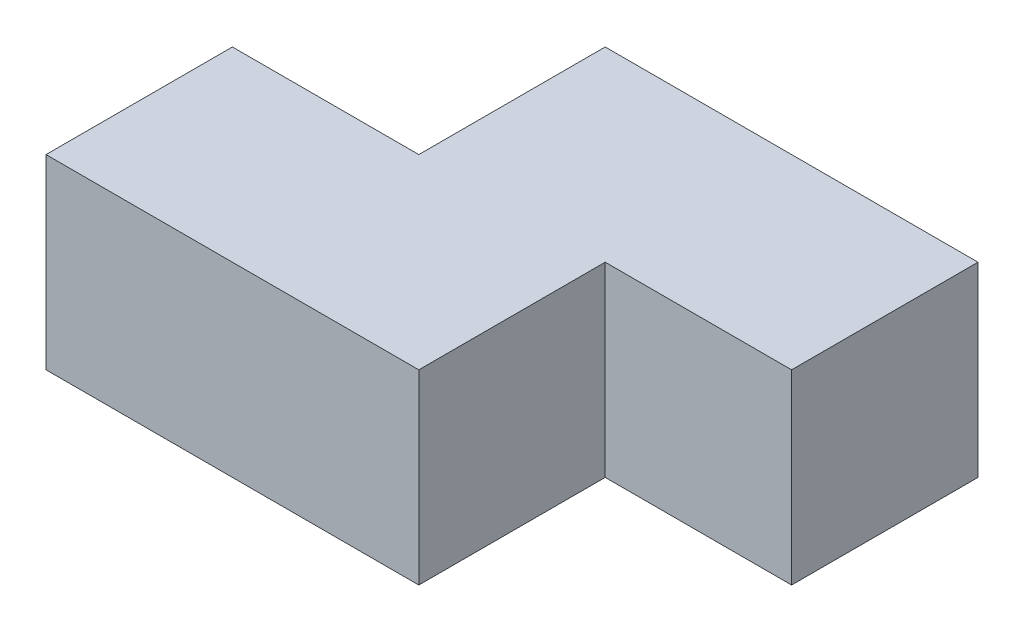
ISO-10303-21;
HEADER;
FILE_DESCRIPTION(('STEP AP214'),'2;1');
FILE_NAME('part.step','',(''),(''),'','','');
FILE_SCHEMA(('AUTOMOTIVE_DESIGN { 1 0 10303 214 1 1 1 1 }'));
ENDSEC;
DATA;
#1=APPLICATION_CONTEXT('core data for automotive mechanical design processes');
#2=APPLICATION_PROTOCOL_DEFINITION('international standard','automotive_design',2000,#1);
#3=PRODUCT_CONTEXT('',#1,'mechanical');
#4=PRODUCT('Part','Part','',(#3));
#5=PRODUCT_RELATED_PRODUCT_CATEGORY('part','',(#4));
#6=PRODUCT_DEFINITION_FORMATION('','',#4);
#7=PRODUCT_DEFINITION_CONTEXT('part definition',#1,'design');
#8=PRODUCT_DEFINITION('design','',#6,#7);
#9=PRODUCT_DEFINITION_SHAPE('','',#8);
#10=(LENGTH_UNIT() NAMED_UNIT(*) SI_UNIT(.MILLI.,.METRE.));
#11=(NAMED_UNIT(*) PLANE_ANGLE_UNIT() SI_UNIT($,.RADIAN.));
#12=(NAMED_UNIT(*) SI_UNIT($,.STERADIAN.) SOLID_ANGLE_UNIT());
#13=UNCERTAINTY_MEASURE_WITH_UNIT(LENGTH_MEASURE(1.E-05),#10,'distance_accuracy_value','');
#14=(GEOMETRIC_REPRESENTATION_CONTEXT(3) GLOBAL_UNCERTAINTY_ASSIGNED_CONTEXT((#13)) GLOBAL_UNIT_ASSIGNED_CONTEXT((#10,
#11,#12)) REPRESENTATION_CONTEXT('',''));
#15=CARTESIAN_POINT('',(0.,0.,0.));
#16=DIRECTION('',(0.,0.,1.));
#17=DIRECTION('',(1.,0.,0.));
#18=AXIS2_PLACEMENT_3D('',#15,#16,#17);
#19=CARTESIAN_POINT('',(0.,200.,0.));
#20=DIRECTION('',(1.,0.,0.));
#21=DIRECTION('',(0.,0.,-1.));
#22=AXIS2_PLACEMENT_3D('',#19,#20,#21);
#23=PLANE('',#22);
#24=DIRECTION('',(0.,0.,1.));
#25=VECTOR('',#24,1.);
#26=CARTESIAN_POINT('',(0.,0.,0.));
#27=LINE('',#26,#25);
#28=CARTESIAN_POINT('',(0.,0.,-200.));
#29=VERTEX_POINT('',#28);
#30=CARTESIAN_POINT('',(0.,0.,0.));
#31=VERTEX_POINT('',#30);
#32=EDGE_CURVE('E140',#29,#31,#27,.T.);
#33=ORIENTED_EDGE('',*,*,#32,.T.);
#34=DIRECTION('',(0.,-1.,0.));
#35=VECTOR('',#34,1.);
#36=CARTESIAN_POINT('',(0.,200.,0.));
#37=LINE('',#36,#35);
#38=CARTESIAN_POINT('',(0.,200.,0.));
#39=VERTEX_POINT('',#38);
#40=EDGE_CURVE('E11',#39,#31,#37,.T.);
#41=ORIENTED_EDGE('',*,*,#40,.F.);
#42=DIRECTION('',(0.,0.,1.));
#43=VECTOR('',#42,1.);
#44=CARTESIAN_POINT('',(0.,200.,0.));
#45=LINE('',#44,#43);
#46=CARTESIAN_POINT('',(0.,200.,-200.));
#47=VERTEX_POINT('',#46);
#48=EDGE_CURVE('E162',#47,#39,#45,.T.);
#49=ORIENTED_EDGE('',*,*,#48,.F.);
#50=DIRECTION('',(0.,-1.,0.));
#51=VECTOR('',#50,1.);
#52=CARTESIAN_POINT('',(0.,200.,-200.));
#53=LINE('',#52,#51);
#54=EDGE_CURVE('E136',#47,#29,#53,.T.);
#55=ORIENTED_EDGE('',*,*,#54,.T.);
#56=EDGE_LOOP('',(#33,#41,#49,#55));
#57=FACE_BOUND('',#56,.T.);
#58=ADVANCED_FACE('F39',(#57),#23,.F.);
#59=CARTESIAN_POINT('',(0.,200.,0.));
#60=DIRECTION('',(0.,0.,-1.));
#61=DIRECTION('',(-1.,0.,0.));
#62=AXIS2_PLACEMENT_3D('',#59,#60,#61);
#63=PLANE('',#62);
#64=DIRECTION('',(1.,0.,0.));
#65=VECTOR('',#64,1.);
#66=CARTESIAN_POINT('',(0.,0.,0.));
#67=LINE('',#66,#65);
#68=CARTESIAN_POINT('',(400.,0.,0.));
#69=VERTEX_POINT('',#68);
#70=EDGE_CURVE('E144',#31,#69,#67,.T.);
#71=ORIENTED_EDGE('',*,*,#70,.T.);
#72=DIRECTION('',(0.,-1.,0.));
#73=VECTOR('',#72,1.);
#74=CARTESIAN_POINT('',(400.,200.,0.));
#75=LINE('',#74,#73);
#76=CARTESIAN_POINT('',(400.,200.,0.));
#77=VERTEX_POINT('',#76);
#78=EDGE_CURVE('E48',#77,#69,#75,.T.);
#79=ORIENTED_EDGE('',*,*,#78,.F.);
#80=DIRECTION('',(1.,0.,0.));
#81=VECTOR('',#80,1.);
#82=CARTESIAN_POINT('',(0.,200.,0.));
#83=LINE('',#82,#81);
#84=EDGE_CURVE('E99',#39,#77,#83,.T.);
#85=ORIENTED_EDGE('',*,*,#84,.F.);
#86=ORIENTED_EDGE('',*,*,#40,.T.);
#87=EDGE_LOOP('',(#71,#79,#85,#86));
#88=FACE_BOUND('',#87,.T.);
#89=ADVANCED_FACE('F208',(#88),#63,.F.);
#90=CARTESIAN_POINT('',(400.,200.,0.));
#91=DIRECTION('',(-1.,0.,0.));
#92=DIRECTION('',(0.,0.,1.));
#93=AXIS2_PLACEMENT_3D('',#90,#91,#92);
#94=PLANE('',#93);
#95=DIRECTION('',(0.,0.,-1.));
#96=VECTOR('',#95,1.);
#97=CARTESIAN_POINT('',(400.,0.,0.));
#98=LINE('',#97,#96);
#99=CARTESIAN_POINT('',(400.,0.,-200.));
#100=VERTEX_POINT('',#99);
#101=EDGE_CURVE('E147',#69,#100,#98,.T.);
#102=ORIENTED_EDGE('',*,*,#101,.T.);
#103=DIRECTION('',(0.,-1.,0.));
#104=VECTOR('',#103,1.);
#105=CARTESIAN_POINT('',(400.,200.,-200.));
#106=LINE('',#105,#104);
#107=CARTESIAN_POINT('',(400.,200.,-200.));
#108=VERTEX_POINT('',#107);
#109=EDGE_CURVE('E173',#108,#100,#106,.T.);
#110=ORIENTED_EDGE('',*,*,#109,.F.);
#111=DIRECTION('',(0.,0.,-1.));
#112=VECTOR('',#111,1.);
#113=CARTESIAN_POINT('',(400.,200.,0.));
#114=LINE('',#113,#112);
#115=EDGE_CURVE('E183',#77,#108,#114,.T.);
#116=ORIENTED_EDGE('',*,*,#115,.F.);
#117=ORIENTED_EDGE('',*,*,#78,.T.);
#118=EDGE_LOOP('',(#102,#110,#116,#117));
#119=FACE_BOUND('',#118,.T.);
#120=ADVANCED_FACE('F181',(#119),#94,.F.);
#121=CARTESIAN_POINT('',(400.,200.,-200.));
#122=DIRECTION('',(0.,0.,-1.));
#123=DIRECTION('',(-1.,0.,0.));
#124=AXIS2_PLACEMENT_3D('',#121,#122,#123);
#125=PLANE('',#124);
#126=DIRECTION('',(1.,0.,0.));
#127=VECTOR('',#126,1.);
#128=CARTESIAN_POINT('',(400.,0.,-200.));
#129=LINE('',#128,#127);
#130=CARTESIAN_POINT('',(600.,0.,-200.));
#131=VERTEX_POINT('',#130);
#132=EDGE_CURVE('E150',#100,#131,#129,.T.);
#133=ORIENTED_EDGE('',*,*,#132,.T.);
#134=DIRECTION('',(0.,-1.,0.));
#135=VECTOR('',#134,1.);
#136=CARTESIAN_POINT('',(600.,200.,-200.));
#137=LINE('',#136,#135);
#138=CARTESIAN_POINT('',(600.,200.,-200.));
#139=VERTEX_POINT('',#138);
#140=EDGE_CURVE('E169',#139,#131,#137,.T.);
#141=ORIENTED_EDGE('',*,*,#140,.F.);
#142=DIRECTION('',(1.,0.,0.));
#143=VECTOR('',#142,1.);
#144=CARTESIAN_POINT('',(400.,200.,-200.));
#145=LINE('',#144,#143);
#146=EDGE_CURVE('E196',#108,#139,#145,.T.);
#147=ORIENTED_EDGE('',*,*,#146,.F.);
#148=ORIENTED_EDGE('',*,*,#109,.T.);
#149=EDGE_LOOP('',(#133,#141,#147,#148));
#150=FACE_BOUND('',#149,.T.);
#151=ADVANCED_FACE('F191',(#150),#125,.F.);
#152=CARTESIAN_POINT('',(600.,200.,-200.));
#153=DIRECTION('',(-1.,0.,0.));
#154=DIRECTION('',(0.,0.,1.));
#155=AXIS2_PLACEMENT_3D('',#152,#153,#154);
#156=PLANE('',#155);
#157=DIRECTION('',(0.,0.,-1.));
#158=VECTOR('',#157,1.);
#159=CARTESIAN_POINT('',(600.,0.,-200.));
#160=LINE('',#159,#158);
#161=CARTESIAN_POINT('',(600.,0.,-400.));
#162=VERTEX_POINT('',#161);
#163=EDGE_CURVE('E153',#131,#162,#160,.T.);
#164=ORIENTED_EDGE('',*,*,#163,.T.);
#165=DIRECTION('',(0.,-1.,0.));
#166=VECTOR('',#165,1.);
#167=CARTESIAN_POINT('',(600.,200.,-400.));
#168=LINE('',#167,#166);
#169=CARTESIAN_POINT('',(600.,200.,-400.));
#170=VERTEX_POINT('',#169);
#171=EDGE_CURVE('E129',#170,#162,#168,.T.);
#172=ORIENTED_EDGE('',*,*,#171,.F.);
#173=DIRECTION('',(0.,0.,-1.));
#174=VECTOR('',#173,1.);
#175=CARTESIAN_POINT('',(600.,200.,-200.));
#176=LINE('',#175,#174);
#177=EDGE_CURVE('E118',#139,#170,#176,.T.);
#178=ORIENTED_EDGE('',*,*,#177,.F.);
#179=ORIENTED_EDGE('',*,*,#140,.T.);
#180=EDGE_LOOP('',(#164,#172,#178,#179));
#181=FACE_BOUND('',#180,.T.);
#182=ADVANCED_FACE('F194',(#181),#156,.F.);
#183=CARTESIAN_POINT('',(200.,200.,-400.));
#184=DIRECTION('',(0.,0.,1.));
#185=DIRECTION('',(1.,0.,0.));
#186=AXIS2_PLACEMENT_3D('',#183,#184,#185);
#187=PLANE('',#186);
#188=DIRECTION('',(-1.,0.,0.));
#189=VECTOR('',#188,1.);
#190=CARTESIAN_POINT('',(200.,0.,-400.));
#191=LINE('',#190,#189);
#192=CARTESIAN_POINT('',(200.,0.,-400.));
#193=VERTEX_POINT('',#192);
#194=EDGE_CURVE('E127',#162,#193,#191,.T.);
#195=ORIENTED_EDGE('',*,*,#194,.T.);
#196=DIRECTION('',(0.,-1.,0.));
#197=VECTOR('',#196,1.);
#198=CARTESIAN_POINT('',(200.,200.,-400.));
#199=LINE('',#198,#197);
#200=CARTESIAN_POINT('',(200.,200.,-400.));
#201=VERTEX_POINT('',#200);
#202=EDGE_CURVE('E124',#201,#193,#199,.T.);
#203=ORIENTED_EDGE('',*,*,#202,.F.);
#204=DIRECTION('',(-1.,0.,0.));
#205=VECTOR('',#204,1.);
#206=CARTESIAN_POINT('',(200.,200.,-400.));
#207=LINE('',#206,#205);
#208=EDGE_CURVE('E112',#170,#201,#207,.T.);
#209=ORIENTED_EDGE('',*,*,#208,.F.);
#210=ORIENTED_EDGE('',*,*,#171,.T.);
#211=EDGE_LOOP('',(#195,#203,#209,#210));
#212=FACE_BOUND('',#211,.T.);
#213=ADVANCED_FACE('F125',(#212),#187,.F.);
#214=CARTESIAN_POINT('',(200.,200.,-200.));
#215=DIRECTION('',(1.,0.,0.));
#216=DIRECTION('',(0.,0.,-1.));
#217=AXIS2_PLACEMENT_3D('',#214,#215,#216);
#218=PLANE('',#217);
#219=DIRECTION('',(0.,0.,1.));
#220=VECTOR('',#219,1.);
#221=CARTESIAN_POINT('',(200.,0.,-200.));
#222=LINE('',#221,#220);
#223=CARTESIAN_POINT('',(200.,0.,-200.));
#224=VERTEX_POINT('',#223);
#225=EDGE_CURVE('E85',#193,#224,#222,.T.);
#226=ORIENTED_EDGE('',*,*,#225,.T.);
#227=DIRECTION('',(0.,-1.,0.));
#228=VECTOR('',#227,1.);
#229=CARTESIAN_POINT('',(200.,200.,-200.));
#230=LINE('',#229,#228);
#231=CARTESIAN_POINT('',(200.,200.,-200.));
#232=VERTEX_POINT('',#231);
#233=EDGE_CURVE('E130',#232,#224,#230,.T.);
#234=ORIENTED_EDGE('',*,*,#233,.F.);
#235=DIRECTION('',(0.,0.,1.));
#236=VECTOR('',#235,1.);
#237=CARTESIAN_POINT('',(200.,200.,-200.));
#238=LINE('',#237,#236);
#239=EDGE_CURVE('E116',#201,#232,#238,.T.);
#240=ORIENTED_EDGE('',*,*,#239,.F.);
#241=ORIENTED_EDGE('',*,*,#202,.T.);
#242=EDGE_LOOP('',(#226,#234,#240,#241));
#243=FACE_BOUND('',#242,.T.);
#244=ADVANCED_FACE('F132',(#243),#218,.F.);
#245=CARTESIAN_POINT('',(0.,200.,-200.));
#246=DIRECTION('',(0.,0.,1.));
#247=DIRECTION('',(1.,0.,0.));
#248=AXIS2_PLACEMENT_3D('',#245,#246,#247);
#249=PLANE('',#248);
#250=DIRECTION('',(-1.,0.,0.));
#251=VECTOR('',#250,1.);
#252=CARTESIAN_POINT('',(0.,0.,-200.));
#253=LINE('',#252,#251);
#254=EDGE_CURVE('E91',#224,#29,#253,.T.);
#255=ORIENTED_EDGE('',*,*,#254,.T.);
#256=ORIENTED_EDGE('',*,*,#54,.F.);
#257=DIRECTION('',(-1.,0.,0.));
#258=VECTOR('',#257,1.);
#259=CARTESIAN_POINT('',(0.,200.,-200.));
#260=LINE('',#259,#258);
#261=EDGE_CURVE('E56',#232,#47,#260,.T.);
#262=ORIENTED_EDGE('',*,*,#261,.F.);
#263=ORIENTED_EDGE('',*,*,#233,.T.);
#264=EDGE_LOOP('',(#255,#256,#262,#263));
#265=FACE_BOUND('',#264,.T.);
#266=ADVANCED_FACE('F224',(#265),#249,.F.);
#267=CARTESIAN_POINT('',(0.,200.,0.));
#268=DIRECTION('',(0.,-1.,0.));
#269=DIRECTION('',(0.,0.,-1.));
#270=AXIS2_PLACEMENT_3D('',#267,#268,#269);
#271=PLANE('',#270);
#272=ORIENTED_EDGE('',*,*,#48,.T.);
#273=ORIENTED_EDGE('',*,*,#84,.T.);
#274=ORIENTED_EDGE('',*,*,#115,.T.);
#275=ORIENTED_EDGE('',*,*,#146,.T.);
#276=ORIENTED_EDGE('',*,*,#177,.T.);
#277=ORIENTED_EDGE('',*,*,#208,.T.);
#278=ORIENTED_EDGE('',*,*,#239,.T.);
#279=ORIENTED_EDGE('',*,*,#261,.T.);
#280=EDGE_LOOP('',(#272,#273,#274,#275,#276,#277,#278,#279));
#281=FACE_BOUND('',#280,.T.);
#282=ADVANCED_FACE('F114',(#281),#271,.F.);
#283=CARTESIAN_POINT('',(0.,0.,0.));
#284=DIRECTION('',(0.,-1.,0.));
#285=DIRECTION('',(0.,0.,-1.));
#286=AXIS2_PLACEMENT_3D('',#283,#284,#285);
#287=PLANE('',#286);
#288=ORIENTED_EDGE('',*,*,#32,.F.);
#289=ORIENTED_EDGE('',*,*,#254,.F.);
#290=ORIENTED_EDGE('',*,*,#225,.F.);
#291=ORIENTED_EDGE('',*,*,#194,.F.);
#292=ORIENTED_EDGE('',*,*,#163,.F.);
#293=ORIENTED_EDGE('',*,*,#132,.F.);
#294=ORIENTED_EDGE('',*,*,#101,.F.);
#295=ORIENTED_EDGE('',*,*,#70,.F.);
#296=EDGE_LOOP('',(#288,#289,#290,#291,#292,#293,#294,#295));
#297=FACE_BOUND('',#296,.T.);
#298=ADVANCED_FACE('F187',(#297),#287,.T.);
#299=CLOSED_SHELL('',(#58,#89,#120,#151,#182,#213,#244,#266,#282,#298));
#300=MANIFOLD_SOLID_BREP('B2',#299);
#301=ADVANCED_BREP_SHAPE_REPRESENTATION('',(#18,#300),#14);
#302=SHAPE_DEFINITION_REPRESENTATION(#9,#301);
ENDSEC;
END-ISO-10303-21;
